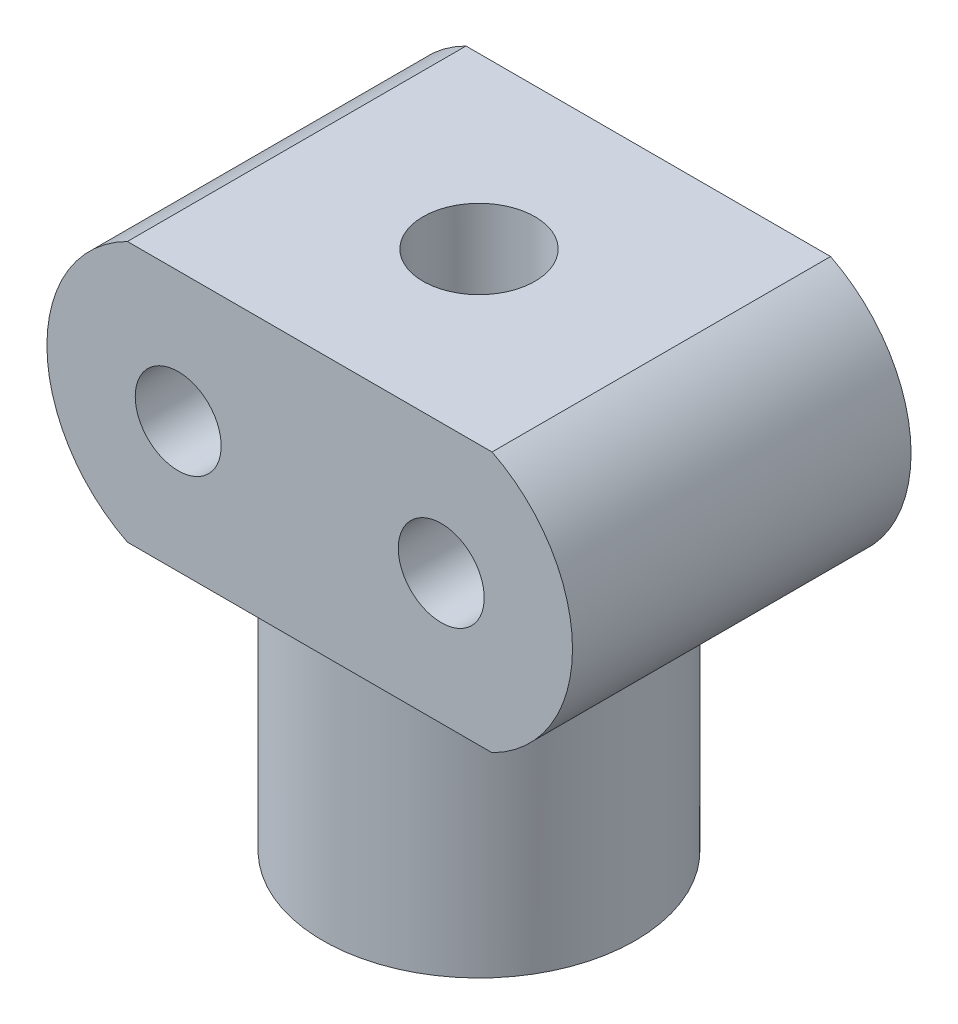
ISO-10303-21;
HEADER;
FILE_DESCRIPTION(('STEP AP214'),'2;1');
FILE_NAME('part.step','',(''),(''),'','','');
FILE_SCHEMA(('AUTOMOTIVE_DESIGN { 1 0 10303 214 1 1 1 1 }'));
ENDSEC;
DATA;
#1=APPLICATION_CONTEXT('core data for automotive mechanical design processes');
#2=APPLICATION_PROTOCOL_DEFINITION('international standard','automotive_design',2000,#1);
#3=PRODUCT_CONTEXT('',#1,'mechanical');
#4=PRODUCT('Part','Part','',(#3));
#5=PRODUCT_RELATED_PRODUCT_CATEGORY('part','',(#4));
#6=PRODUCT_DEFINITION_FORMATION('','',#4);
#7=PRODUCT_DEFINITION_CONTEXT('part definition',#1,'design');
#8=PRODUCT_DEFINITION('design','',#6,#7);
#9=PRODUCT_DEFINITION_SHAPE('','',#8);
#10=(LENGTH_UNIT() NAMED_UNIT(*) SI_UNIT(.MILLI.,.METRE.));
#11=(NAMED_UNIT(*) PLANE_ANGLE_UNIT() SI_UNIT($,.RADIAN.));
#12=(NAMED_UNIT(*) SI_UNIT($,.STERADIAN.) SOLID_ANGLE_UNIT());
#13=UNCERTAINTY_MEASURE_WITH_UNIT(LENGTH_MEASURE(1.E-05),#10,'distance_accuracy_value','');
#14=(GEOMETRIC_REPRESENTATION_CONTEXT(3) GLOBAL_UNCERTAINTY_ASSIGNED_CONTEXT((#13)) GLOBAL_UNIT_ASSIGNED_CONTEXT((#10,
#11,#12)) REPRESENTATION_CONTEXT('',''));
#15=CARTESIAN_POINT('',(0.,0.,0.));
#16=DIRECTION('',(0.,0.,1.));
#17=DIRECTION('',(1.,0.,0.));
#18=AXIS2_PLACEMENT_3D('',#15,#16,#17);
#19=CARTESIAN_POINT('',(7.,-5.,13.));
#20=DIRECTION('',(0.,1.,0.));
#21=DIRECTION('',(-1.,0.,0.));
#22=AXIS2_PLACEMENT_3D('',#19,#20,#21);
#23=PLANE('',#22);
#24=DIRECTION('',(1.,0.,0.));
#25=VECTOR('',#24,1.);
#26=CARTESIAN_POINT('',(7.,-5.,0.));
#27=LINE('',#26,#25);
#28=CARTESIAN_POINT('',(-7.,-5.,0.));
#29=VERTEX_POINT('',#28);
#30=CARTESIAN_POINT('',(7.,-5.,0.));
#31=VERTEX_POINT('',#30);
#32=EDGE_CURVE('E89',#29,#31,#27,.T.);
#33=ORIENTED_EDGE('',*,*,#32,.T.);
#34=DIRECTION('',(0.,0.,-1.));
#35=VECTOR('',#34,1.);
#36=CARTESIAN_POINT('',(7.,-5.,13.));
#37=LINE('',#36,#35);
#38=CARTESIAN_POINT('',(7.,-5.,13.));
#39=VERTEX_POINT('',#38);
#40=EDGE_CURVE('E87',#39,#31,#37,.T.);
#41=ORIENTED_EDGE('',*,*,#40,.F.);
#42=DIRECTION('',(1.,0.,0.));
#43=VECTOR('',#42,1.);
#44=CARTESIAN_POINT('',(7.,-5.,13.));
#45=LINE('',#44,#43);
#46=CARTESIAN_POINT('',(-7.,-5.,13.));
#47=VERTEX_POINT('',#46);
#48=EDGE_CURVE('E79',#47,#39,#45,.T.);
#49=ORIENTED_EDGE('',*,*,#48,.F.);
#50=DIRECTION('',(0.,0.,-1.));
#51=VECTOR('',#50,1.);
#52=CARTESIAN_POINT('',(-7.,-5.,13.));
#53=LINE('',#52,#51);
#54=EDGE_CURVE('E40',#47,#29,#53,.T.);
#55=ORIENTED_EDGE('',*,*,#54,.T.);
#56=EDGE_LOOP('',(#33,#41,#49,#55));
#57=FACE_BOUND('',#56,.T.);
#58=CARTESIAN_POINT('',(0.,-5.,6.5));
#59=DIRECTION('',(0.,1.,0.));
#60=DIRECTION('',(-1.,0.,0.));
#61=AXIS2_PLACEMENT_3D('',#58,#59,#60);
#62=CIRCLE('',#61,6.);
#63=CARTESIAN_POINT('',(-5.99999999999999,-5.,6.5));
#64=VERTEX_POINT('',#63);
#65=EDGE_CURVE('E11',#64,#64,#62,.F.);
#66=ORIENTED_EDGE('',*,*,#65,.F.);
#67=EDGE_LOOP('',(#66));
#68=FACE_BOUND('',#67,.T.);
#69=ADVANCED_FACE('F31',(#57,#68),#23,.F.);
#70=CARTESIAN_POINT('',(-4.5,0.,13.));
#71=DIRECTION('',(0.,0.,-1.));
#72=DIRECTION('',(-1.,0.,0.));
#73=AXIS2_PLACEMENT_3D('',#70,#71,#72);
#74=CYLINDRICAL_SURFACE('',#73,5.59016994374948);
#75=CARTESIAN_POINT('',(-4.5,0.,0.));
#76=DIRECTION('',(0.,0.,1.));
#77=DIRECTION('',(1.,0.,0.));
#78=AXIS2_PLACEMENT_3D('',#75,#76,#77);
#79=CIRCLE('',#78,5.59016994374948);
#80=CARTESIAN_POINT('',(-7.,5.,0.));
#81=VERTEX_POINT('',#80);
#82=EDGE_CURVE('E98',#81,#29,#79,.T.);
#83=ORIENTED_EDGE('',*,*,#82,.T.);
#84=ORIENTED_EDGE('',*,*,#54,.F.);
#85=CARTESIAN_POINT('',(-4.5,0.,13.));
#86=DIRECTION('',(0.,0.,1.));
#87=DIRECTION('',(1.,0.,0.));
#88=AXIS2_PLACEMENT_3D('',#85,#86,#87);
#89=CIRCLE('',#88,5.59016994374948);
#90=CARTESIAN_POINT('',(-7.,5.,13.));
#91=VERTEX_POINT('',#90);
#92=EDGE_CURVE('E84',#91,#47,#89,.T.);
#93=ORIENTED_EDGE('',*,*,#92,.F.);
#94=DIRECTION('',(0.,0.,-1.));
#95=VECTOR('',#94,1.);
#96=CARTESIAN_POINT('',(-7.,5.,13.));
#97=LINE('',#96,#95);
#98=EDGE_CURVE('E94',#91,#81,#97,.T.);
#99=ORIENTED_EDGE('',*,*,#98,.T.);
#100=EDGE_LOOP('',(#83,#84,#93,#99));
#101=FACE_BOUND('',#100,.T.);
#102=ADVANCED_FACE('F33',(#101),#74,.T.);
#103=CARTESIAN_POINT('',(4.5,0.,13.));
#104=DIRECTION('',(0.,0.,-1.));
#105=DIRECTION('',(-1.,0.,0.));
#106=AXIS2_PLACEMENT_3D('',#103,#104,#105);
#107=CYLINDRICAL_SURFACE('',#106,5.59016994374947);
#108=CARTESIAN_POINT('',(4.5,0.,0.));
#109=DIRECTION('',(0.,0.,1.));
#110=DIRECTION('',(-1.,0.,0.));
#111=AXIS2_PLACEMENT_3D('',#108,#109,#110);
#112=CIRCLE('',#111,5.59016994374947);
#113=CARTESIAN_POINT('',(7.,5.,0.));
#114=VERTEX_POINT('',#113);
#115=EDGE_CURVE('E65',#31,#114,#112,.T.);
#116=ORIENTED_EDGE('',*,*,#115,.T.);
#117=DIRECTION('',(0.,0.,-1.));
#118=VECTOR('',#117,1.);
#119=CARTESIAN_POINT('',(7.,5.,13.));
#120=LINE('',#119,#118);
#121=CARTESIAN_POINT('',(7.,5.,13.));
#122=VERTEX_POINT('',#121);
#123=EDGE_CURVE('E90',#122,#114,#120,.T.);
#124=ORIENTED_EDGE('',*,*,#123,.F.);
#125=CARTESIAN_POINT('',(4.5,0.,13.));
#126=DIRECTION('',(0.,0.,1.));
#127=DIRECTION('',(-1.,0.,0.));
#128=AXIS2_PLACEMENT_3D('',#125,#126,#127);
#129=CIRCLE('',#128,5.59016994374947);
#130=EDGE_CURVE('E82',#39,#122,#129,.T.);
#131=ORIENTED_EDGE('',*,*,#130,.F.);
#132=ORIENTED_EDGE('',*,*,#40,.T.);
#133=EDGE_LOOP('',(#116,#124,#131,#132));
#134=FACE_BOUND('',#133,.T.);
#135=ADVANCED_FACE('F92',(#134),#107,.T.);
#136=CARTESIAN_POINT('',(7.,5.,13.));
#137=DIRECTION('',(0.,-1.,0.));
#138=DIRECTION('',(1.,0.,0.));
#139=AXIS2_PLACEMENT_3D('',#136,#137,#138);
#140=PLANE('',#139);
#141=CARTESIAN_POINT('',(0.,5.,6.5));
#142=DIRECTION('',(0.,1.,0.));
#143=DIRECTION('',(-1.,0.,0.));
#144=AXIS2_PLACEMENT_3D('',#141,#142,#143);
#145=CIRCLE('',#144,2.15);
#146=CARTESIAN_POINT('',(-2.15,5.,6.5));
#147=VERTEX_POINT('',#146);
#148=EDGE_CURVE('E139',#147,#147,#145,.T.);
#149=ORIENTED_EDGE('',*,*,#148,.F.);
#150=EDGE_LOOP('',(#149));
#151=FACE_BOUND('',#150,.T.);
#152=DIRECTION('',(-1.,0.,0.));
#153=VECTOR('',#152,1.);
#154=CARTESIAN_POINT('',(7.,5.,0.));
#155=LINE('',#154,#153);
#156=EDGE_CURVE('E71',#114,#81,#155,.T.);
#157=ORIENTED_EDGE('',*,*,#156,.T.);
#158=ORIENTED_EDGE('',*,*,#98,.F.);
#159=DIRECTION('',(-1.,0.,0.));
#160=VECTOR('',#159,1.);
#161=CARTESIAN_POINT('',(7.,5.,13.));
#162=LINE('',#161,#160);
#163=EDGE_CURVE('E48',#122,#91,#162,.T.);
#164=ORIENTED_EDGE('',*,*,#163,.F.);
#165=ORIENTED_EDGE('',*,*,#123,.T.);
#166=EDGE_LOOP('',(#157,#158,#164,#165));
#167=FACE_BOUND('',#166,.T.);
#168=ADVANCED_FACE('F121',(#151,#167),#140,.F.);
#169=CARTESIAN_POINT('',(-4.5,0.,13.));
#170=DIRECTION('',(0.,0.,1.));
#171=DIRECTION('',(1.,0.,0.));
#172=AXIS2_PLACEMENT_3D('',#169,#170,#171);
#173=PLANE('',#172);
#174=CARTESIAN_POINT('',(-5.05,0.,13.));
#175=DIRECTION('',(0.,0.,-1.));
#176=DIRECTION('',(-1.,0.,0.));
#177=AXIS2_PLACEMENT_3D('',#174,#175,#176);
#178=CIRCLE('',#177,1.65);
#179=CARTESIAN_POINT('',(-6.7,0.,13.));
#180=VERTEX_POINT('',#179);
#181=EDGE_CURVE('E150',#180,#180,#178,.T.);
#182=ORIENTED_EDGE('',*,*,#181,.T.);
#183=EDGE_LOOP('',(#182));
#184=FACE_BOUND('',#183,.T.);
#185=CARTESIAN_POINT('',(5.05,0.,13.));
#186=DIRECTION('',(0.,0.,-1.));
#187=DIRECTION('',(-1.,0.,0.));
#188=AXIS2_PLACEMENT_3D('',#185,#186,#187);
#189=CIRCLE('',#188,1.65);
#190=CARTESIAN_POINT('',(3.4,0.,13.));
#191=VERTEX_POINT('',#190);
#192=EDGE_CURVE('E101',#191,#191,#189,.T.);
#193=ORIENTED_EDGE('',*,*,#192,.T.);
#194=EDGE_LOOP('',(#193));
#195=FACE_BOUND('',#194,.T.);
#196=ORIENTED_EDGE('',*,*,#92,.T.);
#197=ORIENTED_EDGE('',*,*,#48,.T.);
#198=ORIENTED_EDGE('',*,*,#130,.T.);
#199=ORIENTED_EDGE('',*,*,#163,.T.);
#200=EDGE_LOOP('',(#196,#197,#198,#199));
#201=FACE_BOUND('',#200,.T.);
#202=ADVANCED_FACE('F80',(#184,#195,#201),#173,.T.);
#203=CARTESIAN_POINT('',(-4.5,0.,0.));
#204=DIRECTION('',(0.,0.,1.));
#205=DIRECTION('',(1.,0.,0.));
#206=AXIS2_PLACEMENT_3D('',#203,#204,#205);
#207=PLANE('',#206);
#208=CARTESIAN_POINT('',(-5.05,0.,0.));
#209=DIRECTION('',(0.,0.,-1.));
#210=DIRECTION('',(-1.,0.,0.));
#211=AXIS2_PLACEMENT_3D('',#208,#209,#210);
#212=CIRCLE('',#211,1.65);
#213=CARTESIAN_POINT('',(-6.7,0.,0.));
#214=VERTEX_POINT('',#213);
#215=EDGE_CURVE('E149',#214,#214,#212,.T.);
#216=ORIENTED_EDGE('',*,*,#215,.F.);
#217=EDGE_LOOP('',(#216));
#218=FACE_BOUND('',#217,.T.);
#219=CARTESIAN_POINT('',(5.05,0.,0.));
#220=DIRECTION('',(0.,0.,-1.));
#221=DIRECTION('',(-1.,0.,0.));
#222=AXIS2_PLACEMENT_3D('',#219,#220,#221);
#223=CIRCLE('',#222,1.65);
#224=CARTESIAN_POINT('',(3.4,0.,0.));
#225=VERTEX_POINT('',#224);
#226=EDGE_CURVE('E153',#225,#225,#223,.T.);
#227=ORIENTED_EDGE('',*,*,#226,.F.);
#228=EDGE_LOOP('',(#227));
#229=FACE_BOUND('',#228,.T.);
#230=ORIENTED_EDGE('',*,*,#82,.F.);
#231=ORIENTED_EDGE('',*,*,#156,.F.);
#232=ORIENTED_EDGE('',*,*,#115,.F.);
#233=ORIENTED_EDGE('',*,*,#32,.F.);
#234=EDGE_LOOP('',(#230,#231,#232,#233));
#235=FACE_BOUND('',#234,.T.);
#236=ADVANCED_FACE('F109',(#218,#229,#235),#207,.F.);
#237=CARTESIAN_POINT('',(5.05,0.,13.));
#238=DIRECTION('',(0.,0.,-1.));
#239=DIRECTION('',(-1.,0.,0.));
#240=AXIS2_PLACEMENT_3D('',#237,#238,#239);
#241=CYLINDRICAL_SURFACE('',#240,1.65);
#242=ORIENTED_EDGE('',*,*,#192,.F.);
#243=EDGE_LOOP('',(#242));
#244=FACE_BOUND('',#243,.T.);
#245=ORIENTED_EDGE('',*,*,#226,.T.);
#246=EDGE_LOOP('',(#245));
#247=FACE_BOUND('',#246,.T.);
#248=ADVANCED_FACE('F111',(#244,#247),#241,.F.);
#249=CARTESIAN_POINT('',(-5.05,0.,13.));
#250=DIRECTION('',(0.,0.,-1.));
#251=DIRECTION('',(-1.,0.,0.));
#252=AXIS2_PLACEMENT_3D('',#249,#250,#251);
#253=CYLINDRICAL_SURFACE('',#252,1.65);
#254=ORIENTED_EDGE('',*,*,#181,.F.);
#255=EDGE_LOOP('',(#254));
#256=FACE_BOUND('',#255,.T.);
#257=ORIENTED_EDGE('',*,*,#215,.T.);
#258=EDGE_LOOP('',(#257));
#259=FACE_BOUND('',#258,.T.);
#260=ADVANCED_FACE('F118',(#256,#259),#253,.F.);
#261=CARTESIAN_POINT('',(0.,-15.,6.5));
#262=DIRECTION('',(0.,1.,0.));
#263=DIRECTION('',(-1.,0.,0.));
#264=AXIS2_PLACEMENT_3D('',#261,#262,#263);
#265=CYLINDRICAL_SURFACE('',#264,6.);
#266=CARTESIAN_POINT('',(0.,-15.,6.5));
#267=DIRECTION('',(0.,-1.,0.));
#268=DIRECTION('',(1.,0.,0.));
#269=AXIS2_PLACEMENT_3D('',#266,#267,#268);
#270=CIRCLE('',#269,6.);
#271=CARTESIAN_POINT('',(6.00000000000001,-15.,6.5));
#272=VERTEX_POINT('',#271);
#273=EDGE_CURVE('E144',#272,#272,#270,.T.);
#274=ORIENTED_EDGE('',*,*,#273,.F.);
#275=EDGE_LOOP('',(#274));
#276=FACE_BOUND('',#275,.T.);
#277=ORIENTED_EDGE('',*,*,#65,.T.);
#278=EDGE_LOOP('',(#277));
#279=FACE_BOUND('',#278,.T.);
#280=ADVANCED_FACE('F165',(#276,#279),#265,.T.);
#281=CARTESIAN_POINT('',(0.,-15.,6.5));
#282=DIRECTION('',(0.,-1.,0.));
#283=DIRECTION('',(1.,0.,0.));
#284=AXIS2_PLACEMENT_3D('',#281,#282,#283);
#285=PLANE('',#284);
#286=CARTESIAN_POINT('',(0.,-15.,6.5));
#287=DIRECTION('',(0.,-1.,0.));
#288=DIRECTION('',(1.,0.,0.));
#289=AXIS2_PLACEMENT_3D('',#286,#287,#288);
#290=CIRCLE('',#289,2.15);
#291=CARTESIAN_POINT('',(2.15,-15.,6.5));
#292=VERTEX_POINT('',#291);
#293=EDGE_CURVE('E141',#292,#292,#290,.F.);
#294=ORIENTED_EDGE('',*,*,#293,.T.);
#295=EDGE_LOOP('',(#294));
#296=FACE_BOUND('',#295,.T.);
#297=ORIENTED_EDGE('',*,*,#273,.T.);
#298=EDGE_LOOP('',(#297));
#299=FACE_BOUND('',#298,.T.);
#300=ADVANCED_FACE('F171',(#296,#299),#285,.T.);
#301=CARTESIAN_POINT('',(0.,-21.0811183182043,6.5));
#302=DIRECTION('',(0.,1.,0.));
#303=DIRECTION('',(-1.,0.,0.));
#304=AXIS2_PLACEMENT_3D('',#301,#302,#303);
#305=CYLINDRICAL_SURFACE('',#304,2.15);
#306=ORIENTED_EDGE('',*,*,#148,.T.);
#307=EDGE_LOOP('',(#306));
#308=FACE_BOUND('',#307,.T.);
#309=ORIENTED_EDGE('',*,*,#293,.F.);
#310=EDGE_LOOP('',(#309));
#311=FACE_BOUND('',#310,.T.);
#312=ADVANCED_FACE('F178',(#308,#311),#305,.F.);
#313=CLOSED_SHELL('',(#69,#102,#135,#168,#202,#236,#248,#260,#280,#300,#312));
#314=MANIFOLD_SOLID_BREP('B2',#313);
#315=ADVANCED_BREP_SHAPE_REPRESENTATION('',(#18,#314),#14);
#316=SHAPE_DEFINITION_REPRESENTATION(#9,#315);
ENDSEC;
END-ISO-10303-21;
